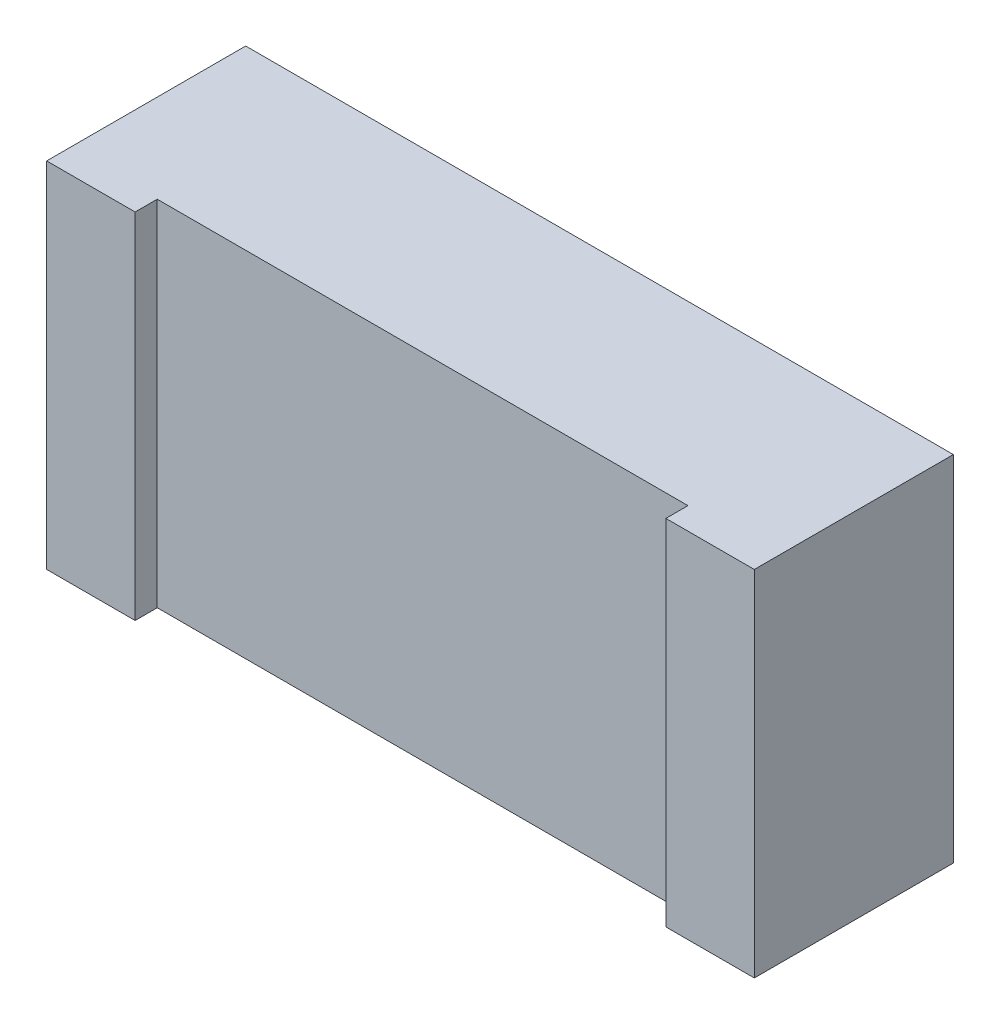
ISO-10303-21;
HEADER;
FILE_DESCRIPTION(('STEP AP214'),'2;1');
FILE_NAME('part.step','',(''),(''),'','','');
FILE_SCHEMA(('AUTOMOTIVE_DESIGN { 1 0 10303 214 1 1 1 1 }'));
ENDSEC;
DATA;
#1=APPLICATION_CONTEXT('core data for automotive mechanical design processes');
#2=APPLICATION_PROTOCOL_DEFINITION('international standard','automotive_design',2000,#1);
#3=PRODUCT_CONTEXT('',#1,'mechanical');
#4=PRODUCT('Part','Part','',(#3));
#5=PRODUCT_RELATED_PRODUCT_CATEGORY('part','',(#4));
#6=PRODUCT_DEFINITION_FORMATION('','',#4);
#7=PRODUCT_DEFINITION_CONTEXT('part definition',#1,'design');
#8=PRODUCT_DEFINITION('design','',#6,#7);
#9=PRODUCT_DEFINITION_SHAPE('','',#8);
#10=(LENGTH_UNIT() NAMED_UNIT(*) SI_UNIT(.MILLI.,.METRE.));
#11=(NAMED_UNIT(*) PLANE_ANGLE_UNIT() SI_UNIT($,.RADIAN.));
#12=(NAMED_UNIT(*) SI_UNIT($,.STERADIAN.) SOLID_ANGLE_UNIT());
#13=UNCERTAINTY_MEASURE_WITH_UNIT(LENGTH_MEASURE(1.E-05),#10,'distance_accuracy_value','');
#14=(GEOMETRIC_REPRESENTATION_CONTEXT(3) GLOBAL_UNCERTAINTY_ASSIGNED_CONTEXT((#13)) GLOBAL_UNIT_ASSIGNED_CONTEXT((#10,
#11,#12)) REPRESENTATION_CONTEXT('',''));
#15=CARTESIAN_POINT('',(0.,0.,0.));
#16=DIRECTION('',(0.,0.,1.));
#17=DIRECTION('',(1.,0.,0.));
#18=AXIS2_PLACEMENT_3D('',#15,#16,#17);
#19=CARTESIAN_POINT('',(-0.8,-0.4,0.45));
#20=DIRECTION('',(0.,1.,0.));
#21=DIRECTION('',(0.,0.,1.));
#22=AXIS2_PLACEMENT_3D('',#19,#20,#21);
#23=PLANE('',#22);
#24=DIRECTION('',(1.,0.,0.));
#25=VECTOR('',#24,1.);
#26=CARTESIAN_POINT('',(-0.8,-0.4,0.45));
#27=LINE('',#26,#25);
#28=CARTESIAN_POINT('',(0.6,-0.4,0.45));
#29=VERTEX_POINT('',#28);
#30=CARTESIAN_POINT('',(0.8,-0.4,0.45));
#31=VERTEX_POINT('',#30);
#32=EDGE_CURVE('E11',#29,#31,#27,.T.);
#33=ORIENTED_EDGE('',*,*,#32,.F.);
#34=DIRECTION('',(0.,0.,1.));
#35=VECTOR('',#34,1.);
#36=CARTESIAN_POINT('',(0.6,-0.4,0.4));
#37=LINE('',#36,#35);
#38=CARTESIAN_POINT('',(0.6,-0.4,0.4));
#39=VERTEX_POINT('',#38);
#40=EDGE_CURVE('E24',#39,#29,#37,.T.);
#41=ORIENTED_EDGE('',*,*,#40,.F.);
#42=DIRECTION('',(1.,0.,0.));
#43=VECTOR('',#42,1.);
#44=CARTESIAN_POINT('',(-0.6,-0.4,0.4));
#45=LINE('',#44,#43);
#46=CARTESIAN_POINT('',(-0.6,-0.4,0.4));
#47=VERTEX_POINT('',#46);
#48=EDGE_CURVE('E142',#47,#39,#45,.T.);
#49=ORIENTED_EDGE('',*,*,#48,.F.);
#50=DIRECTION('',(0.,0.,1.));
#51=VECTOR('',#50,1.);
#52=CARTESIAN_POINT('',(-0.6,-0.4,0.4));
#53=LINE('',#52,#51);
#54=CARTESIAN_POINT('',(-0.6,-0.4,0.45));
#55=VERTEX_POINT('',#54);
#56=EDGE_CURVE('E140',#47,#55,#53,.T.);
#57=ORIENTED_EDGE('',*,*,#56,.T.);
#58=DIRECTION('',(1.,0.,0.));
#59=VECTOR('',#58,1.);
#60=CARTESIAN_POINT('',(-0.8,-0.4,0.45));
#61=LINE('',#60,#59);
#62=CARTESIAN_POINT('',(-0.8,-0.4,0.45));
#63=VERTEX_POINT('',#62);
#64=EDGE_CURVE('E137',#63,#55,#61,.T.);
#65=ORIENTED_EDGE('',*,*,#64,.F.);
#66=DIRECTION('',(0.,0.,-1.));
#67=VECTOR('',#66,1.);
#68=CARTESIAN_POINT('',(-0.8,-0.4,0.45));
#69=LINE('',#68,#67);
#70=CARTESIAN_POINT('',(-0.8,-0.4,0.));
#71=VERTEX_POINT('',#70);
#72=EDGE_CURVE('E135',#63,#71,#69,.T.);
#73=ORIENTED_EDGE('',*,*,#72,.T.);
#74=DIRECTION('',(1.,0.,0.));
#75=VECTOR('',#74,1.);
#76=CARTESIAN_POINT('',(-0.8,-0.4,0.));
#77=LINE('',#76,#75);
#78=CARTESIAN_POINT('',(0.8,-0.4,0.));
#79=VERTEX_POINT('',#78);
#80=EDGE_CURVE('E133',#71,#79,#77,.T.);
#81=ORIENTED_EDGE('',*,*,#80,.T.);
#82=DIRECTION('',(0.,0.,-1.));
#83=VECTOR('',#82,1.);
#84=CARTESIAN_POINT('',(0.8,-0.4,0.45));
#85=LINE('',#84,#83);
#86=EDGE_CURVE('E130',#31,#79,#85,.T.);
#87=ORIENTED_EDGE('',*,*,#86,.F.);
#88=EDGE_LOOP('',(#33,#41,#49,#57,#65,#73,#81,#87));
#89=FACE_BOUND('',#88,.T.);
#90=ADVANCED_FACE('F17',(#89),#23,.F.);
#91=CARTESIAN_POINT('',(-0.8,-0.4,0.45));
#92=DIRECTION('',(0.,0.,1.));
#93=DIRECTION('',(1.,0.,0.));
#94=AXIS2_PLACEMENT_3D('',#91,#92,#93);
#95=PLANE('',#94);
#96=DIRECTION('',(0.,-1.,0.));
#97=VECTOR('',#96,1.);
#98=CARTESIAN_POINT('',(-0.6,0.4,0.45));
#99=LINE('',#98,#97);
#100=CARTESIAN_POINT('',(-0.6,0.4,0.45));
#101=VERTEX_POINT('',#100);
#102=EDGE_CURVE('E127',#101,#55,#99,.T.);
#103=ORIENTED_EDGE('',*,*,#102,.F.);
#104=DIRECTION('',(-1.,0.,0.));
#105=VECTOR('',#104,1.);
#106=CARTESIAN_POINT('',(-0.8,0.4,0.45));
#107=LINE('',#106,#105);
#108=CARTESIAN_POINT('',(-0.8,0.4,0.45));
#109=VERTEX_POINT('',#108);
#110=EDGE_CURVE('E125',#101,#109,#107,.T.);
#111=ORIENTED_EDGE('',*,*,#110,.T.);
#112=DIRECTION('',(0.,-1.,0.));
#113=VECTOR('',#112,1.);
#114=CARTESIAN_POINT('',(-0.8,0.4,0.45));
#115=LINE('',#114,#113);
#116=EDGE_CURVE('E122',#109,#63,#115,.T.);
#117=ORIENTED_EDGE('',*,*,#116,.T.);
#118=ORIENTED_EDGE('',*,*,#64,.T.);
#119=EDGE_LOOP('',(#103,#111,#117,#118));
#120=FACE_BOUND('',#119,.T.);
#121=ADVANCED_FACE('F152',(#120),#95,.T.);
#122=CARTESIAN_POINT('',(-0.8,-0.4,0.));
#123=DIRECTION('',(0.,0.,1.));
#124=DIRECTION('',(1.,0.,0.));
#125=AXIS2_PLACEMENT_3D('',#122,#123,#124);
#126=PLANE('',#125);
#127=DIRECTION('',(0.,-1.,0.));
#128=VECTOR('',#127,1.);
#129=CARTESIAN_POINT('',(-0.8,0.4,0.));
#130=LINE('',#129,#128);
#131=CARTESIAN_POINT('',(-0.8,0.4,0.));
#132=VERTEX_POINT('',#131);
#133=EDGE_CURVE('E119',#132,#71,#130,.T.);
#134=ORIENTED_EDGE('',*,*,#133,.F.);
#135=DIRECTION('',(-1.,0.,0.));
#136=VECTOR('',#135,1.);
#137=CARTESIAN_POINT('',(-0.8,0.4,0.));
#138=LINE('',#137,#136);
#139=CARTESIAN_POINT('',(0.8,0.4,0.));
#140=VERTEX_POINT('',#139);
#141=EDGE_CURVE('E116',#140,#132,#138,.T.);
#142=ORIENTED_EDGE('',*,*,#141,.F.);
#143=DIRECTION('',(0.,1.,0.));
#144=VECTOR('',#143,1.);
#145=CARTESIAN_POINT('',(0.8,0.4,0.));
#146=LINE('',#145,#144);
#147=EDGE_CURVE('E113',#79,#140,#146,.T.);
#148=ORIENTED_EDGE('',*,*,#147,.F.);
#149=ORIENTED_EDGE('',*,*,#80,.F.);
#150=EDGE_LOOP('',(#134,#142,#148,#149));
#151=FACE_BOUND('',#150,.T.);
#152=ADVANCED_FACE('F161',(#151),#126,.F.);
#153=CARTESIAN_POINT('',(0.6,-0.4,0.4));
#154=DIRECTION('',(0.,0.,1.));
#155=DIRECTION('',(1.,0.,0.));
#156=AXIS2_PLACEMENT_3D('',#153,#154,#155);
#157=PLANE('',#156);
#158=DIRECTION('',(0.,1.,0.));
#159=VECTOR('',#158,1.);
#160=CARTESIAN_POINT('',(0.6,0.4,0.4));
#161=LINE('',#160,#159);
#162=CARTESIAN_POINT('',(0.6,0.4,0.4));
#163=VERTEX_POINT('',#162);
#164=EDGE_CURVE('E111',#39,#163,#161,.T.);
#165=ORIENTED_EDGE('',*,*,#164,.T.);
#166=DIRECTION('',(-1.,0.,0.));
#167=VECTOR('',#166,1.);
#168=CARTESIAN_POINT('',(-0.6,0.4,0.4));
#169=LINE('',#168,#167);
#170=CARTESIAN_POINT('',(-0.6,0.4,0.4));
#171=VERTEX_POINT('',#170);
#172=EDGE_CURVE('E92',#163,#171,#169,.T.);
#173=ORIENTED_EDGE('',*,*,#172,.T.);
#174=DIRECTION('',(0.,-1.,0.));
#175=VECTOR('',#174,1.);
#176=CARTESIAN_POINT('',(-0.6,0.4,0.4));
#177=LINE('',#176,#175);
#178=EDGE_CURVE('E107',#171,#47,#177,.T.);
#179=ORIENTED_EDGE('',*,*,#178,.T.);
#180=ORIENTED_EDGE('',*,*,#48,.T.);
#181=EDGE_LOOP('',(#165,#173,#179,#180));
#182=FACE_BOUND('',#181,.T.);
#183=ADVANCED_FACE('F145',(#182),#157,.T.);
#184=CARTESIAN_POINT('',(-0.8,0.4,0.45));
#185=DIRECTION('',(1.,0.,0.));
#186=DIRECTION('',(0.,1.,0.));
#187=AXIS2_PLACEMENT_3D('',#184,#185,#186);
#188=PLANE('',#187);
#189=ORIENTED_EDGE('',*,*,#133,.T.);
#190=ORIENTED_EDGE('',*,*,#72,.F.);
#191=ORIENTED_EDGE('',*,*,#116,.F.);
#192=DIRECTION('',(0.,0.,-1.));
#193=VECTOR('',#192,1.);
#194=CARTESIAN_POINT('',(-0.8,0.4,0.45));
#195=LINE('',#194,#193);
#196=EDGE_CURVE('E104',#109,#132,#195,.T.);
#197=ORIENTED_EDGE('',*,*,#196,.T.);
#198=EDGE_LOOP('',(#189,#190,#191,#197));
#199=FACE_BOUND('',#198,.T.);
#200=ADVANCED_FACE('F156',(#199),#188,.F.);
#201=CARTESIAN_POINT('',(-0.6,0.4,0.4));
#202=DIRECTION('',(-1.,0.,0.));
#203=DIRECTION('',(0.,-1.,0.));
#204=AXIS2_PLACEMENT_3D('',#201,#202,#203);
#205=PLANE('',#204);
#206=ORIENTED_EDGE('',*,*,#102,.T.);
#207=ORIENTED_EDGE('',*,*,#56,.F.);
#208=ORIENTED_EDGE('',*,*,#178,.F.);
#209=DIRECTION('',(0.,0.,1.));
#210=VECTOR('',#209,1.);
#211=CARTESIAN_POINT('',(-0.6,0.4,0.4));
#212=LINE('',#211,#210);
#213=EDGE_CURVE('E101',#171,#101,#212,.T.);
#214=ORIENTED_EDGE('',*,*,#213,.T.);
#215=EDGE_LOOP('',(#206,#207,#208,#214));
#216=FACE_BOUND('',#215,.T.);
#217=ADVANCED_FACE('F149',(#216),#205,.F.);
#218=CARTESIAN_POINT('',(0.8,0.4,0.45));
#219=DIRECTION('',(-1.,0.,0.));
#220=DIRECTION('',(0.,-1.,0.));
#221=AXIS2_PLACEMENT_3D('',#218,#219,#220);
#222=PLANE('',#221);
#223=ORIENTED_EDGE('',*,*,#147,.T.);
#224=DIRECTION('',(0.,0.,-1.));
#225=VECTOR('',#224,1.);
#226=CARTESIAN_POINT('',(0.8,0.4,0.45));
#227=LINE('',#226,#225);
#228=CARTESIAN_POINT('',(0.8,0.4,0.45));
#229=VERTEX_POINT('',#228);
#230=EDGE_CURVE('E99',#229,#140,#227,.T.);
#231=ORIENTED_EDGE('',*,*,#230,.F.);
#232=DIRECTION('',(0.,1.,0.));
#233=VECTOR('',#232,1.);
#234=CARTESIAN_POINT('',(0.8,0.4,0.45));
#235=LINE('',#234,#233);
#236=EDGE_CURVE('E83',#31,#229,#235,.T.);
#237=ORIENTED_EDGE('',*,*,#236,.F.);
#238=ORIENTED_EDGE('',*,*,#86,.T.);
#239=EDGE_LOOP('',(#223,#231,#237,#238));
#240=FACE_BOUND('',#239,.T.);
#241=ADVANCED_FACE('F163',(#240),#222,.F.);
#242=CARTESIAN_POINT('',(0.6,0.4,0.4));
#243=DIRECTION('',(1.,0.,0.));
#244=DIRECTION('',(0.,1.,0.));
#245=AXIS2_PLACEMENT_3D('',#242,#243,#244);
#246=PLANE('',#245);
#247=DIRECTION('',(0.,1.,0.));
#248=VECTOR('',#247,1.);
#249=CARTESIAN_POINT('',(0.6,0.4,0.45));
#250=LINE('',#249,#248);
#251=CARTESIAN_POINT('',(0.6,0.4,0.45));
#252=VERTEX_POINT('',#251);
#253=EDGE_CURVE('E77',#29,#252,#250,.T.);
#254=ORIENTED_EDGE('',*,*,#253,.T.);
#255=DIRECTION('',(0.,0.,1.));
#256=VECTOR('',#255,1.);
#257=CARTESIAN_POINT('',(0.6,0.4,0.4));
#258=LINE('',#257,#256);
#259=EDGE_CURVE('E81',#163,#252,#258,.T.);
#260=ORIENTED_EDGE('',*,*,#259,.F.);
#261=ORIENTED_EDGE('',*,*,#164,.F.);
#262=ORIENTED_EDGE('',*,*,#40,.T.);
#263=EDGE_LOOP('',(#254,#260,#261,#262));
#264=FACE_BOUND('',#263,.T.);
#265=ADVANCED_FACE('F79',(#264),#246,.F.);
#266=CARTESIAN_POINT('',(-0.8,-0.4,0.45));
#267=DIRECTION('',(0.,0.,1.));
#268=DIRECTION('',(1.,0.,0.));
#269=AXIS2_PLACEMENT_3D('',#266,#267,#268);
#270=PLANE('',#269);
#271=ORIENTED_EDGE('',*,*,#253,.F.);
#272=ORIENTED_EDGE('',*,*,#32,.T.);
#273=ORIENTED_EDGE('',*,*,#236,.T.);
#274=DIRECTION('',(-1.,0.,0.));
#275=VECTOR('',#274,1.);
#276=CARTESIAN_POINT('',(-0.8,0.4,0.45));
#277=LINE('',#276,#275);
#278=EDGE_CURVE('E90',#229,#252,#277,.T.);
#279=ORIENTED_EDGE('',*,*,#278,.T.);
#280=EDGE_LOOP('',(#271,#272,#273,#279));
#281=FACE_BOUND('',#280,.T.);
#282=ADVANCED_FACE('F94',(#281),#270,.T.);
#283=CARTESIAN_POINT('',(-0.8,0.4,0.45));
#284=DIRECTION('',(0.,-1.,0.));
#285=DIRECTION('',(1.,0.,0.));
#286=AXIS2_PLACEMENT_3D('',#283,#284,#285);
#287=PLANE('',#286);
#288=ORIENTED_EDGE('',*,*,#172,.F.);
#289=ORIENTED_EDGE('',*,*,#259,.T.);
#290=ORIENTED_EDGE('',*,*,#278,.F.);
#291=ORIENTED_EDGE('',*,*,#230,.T.);
#292=ORIENTED_EDGE('',*,*,#141,.T.);
#293=ORIENTED_EDGE('',*,*,#196,.F.);
#294=ORIENTED_EDGE('',*,*,#110,.F.);
#295=ORIENTED_EDGE('',*,*,#213,.F.);
#296=EDGE_LOOP('',(#288,#289,#290,#291,#292,#293,#294,#295));
#297=FACE_BOUND('',#296,.T.);
#298=ADVANCED_FACE('F88',(#297),#287,.F.);
#299=CLOSED_SHELL('',(#90,#121,#152,#183,#200,#217,#241,#265,#282,#298));
#300=MANIFOLD_SOLID_BREP('B1',#299);
#301=ADVANCED_BREP_SHAPE_REPRESENTATION('',(#18,#300),#14);
#302=SHAPE_DEFINITION_REPRESENTATION(#9,#301);
ENDSEC;
END-ISO-10303-21;
